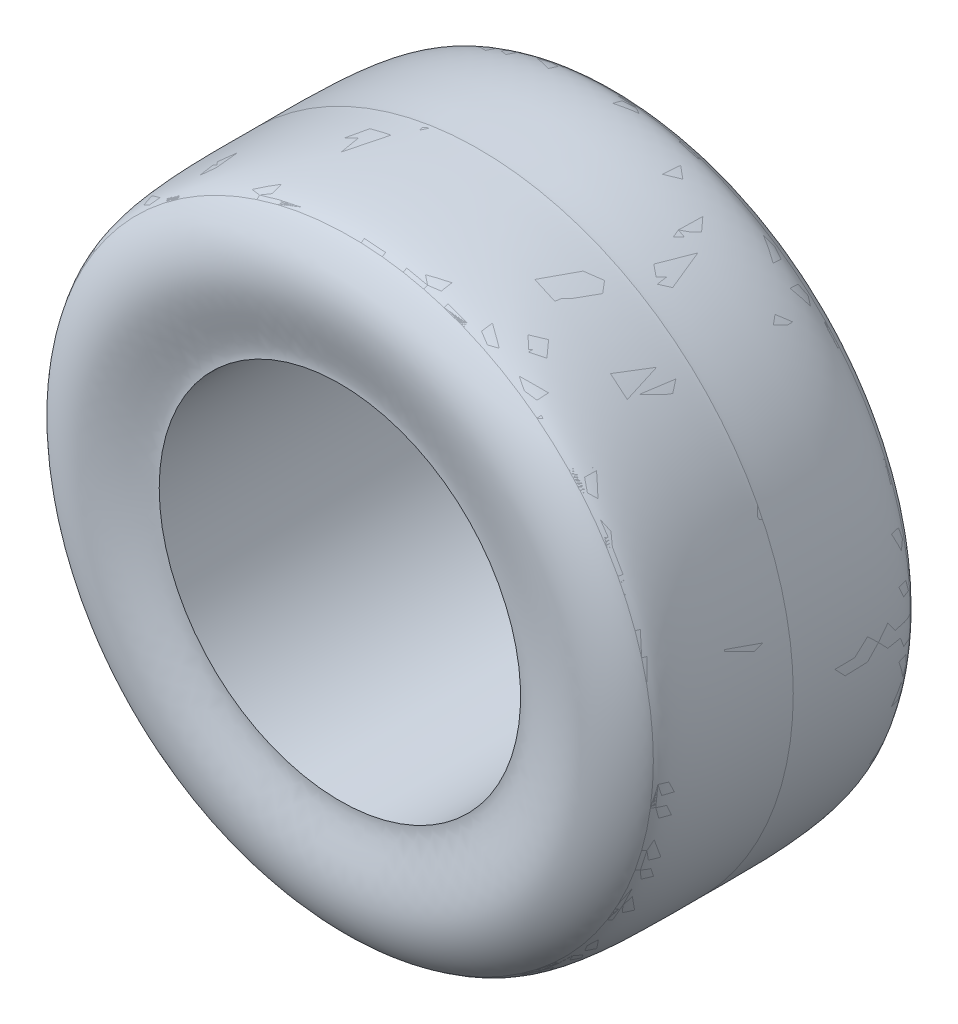
ISO-10303-21;
HEADER;
FILE_DESCRIPTION(('STEP AP214'),'2;1');
FILE_NAME('part.step','',(''),(''),'','','');
FILE_SCHEMA(('AUTOMOTIVE_DESIGN { 1 0 10303 214 1 1 1 1 }'));
ENDSEC;
DATA;
#1=APPLICATION_CONTEXT('core data for automotive mechanical design processes');
#2=APPLICATION_PROTOCOL_DEFINITION('international standard','automotive_design',2000,#1);
#3=PRODUCT_CONTEXT('',#1,'mechanical');
#4=PRODUCT('Part','Part','',(#3));
#5=PRODUCT_RELATED_PRODUCT_CATEGORY('part','',(#4));
#6=PRODUCT_DEFINITION_FORMATION('','',#4);
#7=PRODUCT_DEFINITION_CONTEXT('part definition',#1,'design');
#8=PRODUCT_DEFINITION('design','',#6,#7);
#9=PRODUCT_DEFINITION_SHAPE('','',#8);
#10=(LENGTH_UNIT() NAMED_UNIT(*) SI_UNIT(.MILLI.,.METRE.));
#11=(NAMED_UNIT(*) PLANE_ANGLE_UNIT() SI_UNIT($,.RADIAN.));
#12=(NAMED_UNIT(*) SI_UNIT($,.STERADIAN.) SOLID_ANGLE_UNIT());
#13=UNCERTAINTY_MEASURE_WITH_UNIT(LENGTH_MEASURE(1.E-05),#10,'distance_accuracy_value','');
#14=(GEOMETRIC_REPRESENTATION_CONTEXT(3) GLOBAL_UNCERTAINTY_ASSIGNED_CONTEXT((#13)) GLOBAL_UNIT_ASSIGNED_CONTEXT((#10,
#11,#12)) REPRESENTATION_CONTEXT('',''));
#15=CARTESIAN_POINT('',(0.,0.,0.));
#16=DIRECTION('',(0.,0.,1.));
#17=DIRECTION('',(1.,0.,0.));
#18=AXIS2_PLACEMENT_3D('',#15,#16,#17);
#19=CARTESIAN_POINT('',(6.66133814775094E-13,286.999999999999,0.));
#20=CARTESIAN_POINT('',(0.,286.826687195733,-4.07927990424906));
#21=CARTESIAN_POINT('',(4.44089209850063E-13,288.284046758604,-106.061876701454));
#22=CARTESIAN_POINT('',(4.44089209850063E-13,278.88009318183,-113.606283575162));
#23=CARTESIAN_POINT('',(4.44089209850063E-13,276.507310694476,-117.286167083316));
#24=B_SPLINE_CURVE_WITH_KNOTS('',3,(#19,#20,#21,#22,#23),.UNSPECIFIED.,.F.,.F.,(4,1,4),(0.,
0.0647514781094205,0.299257628346607),.UNSPECIFIED.);
#25=CARTESIAN_POINT('',(4.44089209850063E-13,-8.88178419700125E-13,146.251356053782));
#26=DIRECTION('',(0.,0.,1.));
#27=AXIS1_PLACEMENT('',#25,#26);
#28=SURFACE_OF_REVOLUTION('',#24,#27);
#29=CARTESIAN_POINT('',(2.22044604925031E-13,0.,-117.286167083317));
#30=DIRECTION('',(0.,0.,1.));
#31=DIRECTION('',(1.,0.,0.));
#32=AXIS2_PLACEMENT_3D('',#29,#30,#31);
#33=CIRCLE('',#32,276.507310694478);
#34=CARTESIAN_POINT('',(276.507310694478,0.,-117.286167083317));
#35=VERTEX_POINT('',#34);
#36=EDGE_CURVE('E11',#35,#35,#33,.T.);
#37=ORIENTED_EDGE('',*,*,#36,.T.);
#38=EDGE_LOOP('',(#37));
#39=FACE_BOUND('',#38,.T.);
#40=CARTESIAN_POINT('',(0.,0.,0.));
#41=DIRECTION('',(0.,0.,1.));
#42=DIRECTION('',(1.,0.,0.));
#43=AXIS2_PLACEMENT_3D('',#40,#41,#42);
#44=CIRCLE('',#43,287.);
#45=CARTESIAN_POINT('',(287.,0.,0.));
#46=VERTEX_POINT('',#45);
#47=EDGE_CURVE('E53',#46,#46,#44,.T.);
#48=ORIENTED_EDGE('',*,*,#47,.F.);
#49=EDGE_LOOP('',(#48));
#50=FACE_BOUND('',#49,.T.);
#51=ADVANCED_FACE('F47',(#39,#50),#28,.F.);
#52=CARTESIAN_POINT('',(6.66133814775094E-13,286.999999999999,0.));
#53=CARTESIAN_POINT('',(4.44089209850063E-13,286.826687195733,4.07927990424917));
#54=CARTESIAN_POINT('',(0.,288.284046758605,106.06187670146));
#55=CARTESIAN_POINT('',(4.44089209850063E-13,278.88009318183,113.606283575162));
#56=CARTESIAN_POINT('',(2.22044604925031E-13,276.507310694477,117.286167083317));
#57=B_SPLINE_CURVE_WITH_KNOTS('',3,(#52,#53,#54,#55,#56),.UNSPECIFIED.,.F.,.F.,(4,1,4),(0.,
0.0647514781094217,0.299257628346619),.UNSPECIFIED.);
#58=CARTESIAN_POINT('',(4.44089209850063E-13,-8.88178419700125E-13,146.251356053782));
#59=DIRECTION('',(0.,0.,1.));
#60=AXIS1_PLACEMENT('',#58,#59);
#61=SURFACE_OF_REVOLUTION('',#57,#60);
#62=CARTESIAN_POINT('',(0.,-1.33226762955019E-12,117.286167083317));
#63=DIRECTION('',(0.,0.,1.));
#64=DIRECTION('',(1.,0.,0.));
#65=AXIS2_PLACEMENT_3D('',#62,#63,#64);
#66=CIRCLE('',#65,276.507310694478);
#67=CARTESIAN_POINT('',(276.507310694478,-1.32773740710641E-12,117.286167083317));
#68=VERTEX_POINT('',#67);
#69=EDGE_CURVE('E60',#68,#68,#66,.T.);
#70=ORIENTED_EDGE('',*,*,#69,.F.);
#71=EDGE_LOOP('',(#70));
#72=FACE_BOUND('',#71,.T.);
#73=ORIENTED_EDGE('',*,*,#47,.T.);
#74=EDGE_LOOP('',(#73));
#75=FACE_BOUND('',#74,.T.);
#76=ADVANCED_FACE('F78',(#72,#75),#61,.T.);
#77=OPEN_SHELL('',(#51,#76));
#78=SHELL_BASED_SURFACE_MODEL('B2',(#77));
#79=CARTESIAN_POINT('',(2.22044604925031E-13,276.507310694477,117.286167083317));
#80=CARTESIAN_POINT('',(4.44089209850063E-13,276.352628775456,117.526059043853));
#81=CARTESIAN_POINT('',(0.,273.033066490221,123.196173431544));
#82=CARTESIAN_POINT('',(0.,236.210615054694,155.207133320947));
#83=CARTESIAN_POINT('',(4.44089209850063E-13,177.981971129758,126.019447419683));
#84=CARTESIAN_POINT('',(2.22044604925031E-13,164.999999999999,127.));
#85=B_SPLINE_CURVE_WITH_KNOTS('',3,(#79,#80,#81,#82,#83,#84),.UNSPECIFIED.,.F.,.F.,(4,1,1,4),
(0.299257628346619,0.314545106880506,0.697277584134524,1.),.UNSPECIFIED.);
#86=CARTESIAN_POINT('',(4.44089209850063E-13,-8.88178419700125E-13,-194.897474353297));
#87=DIRECTION('',(0.,0.,-1.));
#88=AXIS1_PLACEMENT('',#86,#87);
#89=SURFACE_OF_REVOLUTION('',#85,#88);
#90=CARTESIAN_POINT('',(2.22044604925031E-13,-8.88178419700125E-13,127.));
#91=DIRECTION('',(0.,0.,-1.));
#92=DIRECTION('',(-1.,0.,0.));
#93=AXIS2_PLACEMENT_3D('',#90,#91,#92);
#94=CIRCLE('',#93,165.);
#95=CARTESIAN_POINT('',(-165.,-8.90881735939199E-13,127.));
#96=VERTEX_POINT('',#95);
#97=EDGE_CURVE('E46',#96,#96,#94,.T.);
#98=ORIENTED_EDGE('',*,*,#97,.T.);
#99=EDGE_LOOP('',(#98));
#100=FACE_BOUND('',#99,.T.);
#101=CARTESIAN_POINT('',(0.,-1.33226762955019E-12,117.286167083317));
#102=DIRECTION('',(0.,0.,-1.));
#103=DIRECTION('',(-1.,0.,0.));
#104=AXIS2_PLACEMENT_3D('',#101,#102,#103);
#105=CIRCLE('',#104,276.507310694478);
#106=CARTESIAN_POINT('',(-276.507310694478,-1.33679785199396E-12,117.286167083317));
#107=VERTEX_POINT('',#106);
#108=EDGE_CURVE('E130',#107,#107,#105,.T.);
#109=ORIENTED_EDGE('',*,*,#108,.F.);
#110=EDGE_LOOP('',(#109));
#111=FACE_BOUND('',#110,.T.);
#112=ADVANCED_FACE('F115',(#100,#111),#89,.F.);
#113=CARTESIAN_POINT('',(4.44089209850063E-13,-8.88178419700125E-13,-194.897474353297));
#114=DIRECTION('',(0.,0.,-1.));
#115=DIRECTION('',(-1.,0.,0.));
#116=AXIS2_PLACEMENT_3D('',#113,#114,#115);
#117=CYLINDRICAL_SURFACE('',#116,165.);
#118=CARTESIAN_POINT('',(0.,0.,-127.));
#119=DIRECTION('',(0.,0.,-1.));
#120=DIRECTION('',(-1.,0.,0.));
#121=AXIS2_PLACEMENT_3D('',#118,#119,#120);
#122=CIRCLE('',#121,165.);
#123=CARTESIAN_POINT('',(-165.,0.,-127.));
#124=VERTEX_POINT('',#123);
#125=EDGE_CURVE('E122',#124,#124,#122,.T.);
#126=ORIENTED_EDGE('',*,*,#125,.T.);
#127=EDGE_LOOP('',(#126));
#128=FACE_BOUND('',#127,.T.);
#129=ORIENTED_EDGE('',*,*,#97,.F.);
#130=EDGE_LOOP('',(#129));
#131=FACE_BOUND('',#130,.T.);
#132=ADVANCED_FACE('F149',(#128,#131),#117,.F.);
#133=CARTESIAN_POINT('',(2.22044604925031E-13,164.999999999999,-127.));
#134=CARTESIAN_POINT('',(0.,177.981971129758,-126.019447419682));
#135=CARTESIAN_POINT('',(4.44089209850063E-13,236.210615054692,-155.207133320948));
#136=CARTESIAN_POINT('',(6.66133814775094E-13,273.033066490226,-123.196173431542));
#137=CARTESIAN_POINT('',(2.22044604925031E-13,276.352628775456,-117.526059043852));
#138=CARTESIAN_POINT('',(4.44089209850063E-13,276.507310694476,-117.286167083316));
#139=B_SPLINE_CURVE_WITH_KNOTS('',3,(#133,#134,#135,#136,#137,#138),.UNSPECIFIED.,.F.,.F.,(4,1,
1,4),(0.299257628346607,0.601980044212084,0.984712521466101,1.),.UNSPECIFIED.);
#140=CARTESIAN_POINT('',(4.44089209850063E-13,-8.88178419700125E-13,-194.897474353297));
#141=DIRECTION('',(0.,0.,-1.));
#142=AXIS1_PLACEMENT('',#140,#141);
#143=SURFACE_OF_REVOLUTION('',#139,#142);
#144=CARTESIAN_POINT('',(2.22044604925031E-13,0.,-117.286167083317));
#145=DIRECTION('',(0.,0.,-1.));
#146=DIRECTION('',(-1.,0.,0.));
#147=AXIS2_PLACEMENT_3D('',#144,#145,#146);
#148=CIRCLE('',#147,276.507310694478);
#149=CARTESIAN_POINT('',(-276.507310694477,0.,-117.286167083317));
#150=VERTEX_POINT('',#149);
#151=EDGE_CURVE('E126',#150,#150,#148,.T.);
#152=ORIENTED_EDGE('',*,*,#151,.T.);
#153=EDGE_LOOP('',(#152));
#154=FACE_BOUND('',#153,.T.);
#155=ORIENTED_EDGE('',*,*,#125,.F.);
#156=EDGE_LOOP('',(#155));
#157=FACE_BOUND('',#156,.T.);
#158=ADVANCED_FACE('F145',(#154,#157),#143,.F.);
#159=CARTESIAN_POINT('',(4.44089209850063E-13,-8.88178419700125E-13,-194.897474353297));
#160=DIRECTION('',(0.,0.,-1.));
#161=DIRECTION('',(-1.,0.,0.));
#162=AXIS2_PLACEMENT_3D('',#159,#160,#161);
#163=CYLINDRICAL_SURFACE('',#162,276.507310694478);
#164=ORIENTED_EDGE('',*,*,#108,.T.);
#165=EDGE_LOOP('',(#164));
#166=FACE_BOUND('',#165,.T.);
#167=ORIENTED_EDGE('',*,*,#151,.F.);
#168=EDGE_LOOP('',(#167));
#169=FACE_BOUND('',#168,.T.);
#170=ADVANCED_FACE('F148',(#166,#169),#163,.T.);
#171=CLOSED_SHELL('',(#112,#132,#158,#170));
#172=MANIFOLD_SOLID_BREP('B6',#171);
#173=CARTESIAN_POINT('',(0.,287.,0.));
#174=CARTESIAN_POINT('',(0.,286.826687195734,4.07927990424921));
#175=CARTESIAN_POINT('',(0.,288.284046758605,106.061876701459));
#176=CARTESIAN_POINT('',(0.,278.880093181831,113.606283575162));
#177=CARTESIAN_POINT('',(0.,276.507310694478,117.286167083317));
#178=B_SPLINE_CURVE_WITH_KNOTS('',3,(#173,#174,#175,#176,#177),.UNSPECIFIED.,.F.,.F.,(4,1,4),
(0.,0.0647514781094217,0.299257628346619),.UNSPECIFIED.);
#179=CARTESIAN_POINT('',(0.,0.,146.251356053781));
#180=DIRECTION('',(0.,0.,1.));
#181=AXIS1_PLACEMENT('',#179,#180);
#182=SURFACE_OF_REVOLUTION('',#178,#181);
#183=CARTESIAN_POINT('',(0.,0.,117.286167083317));
#184=DIRECTION('',(0.,0.,1.));
#185=DIRECTION('',(1.,0.,0.));
#186=AXIS2_PLACEMENT_3D('',#183,#184,#185);
#187=CIRCLE('',#186,276.507310694478);
#188=CARTESIAN_POINT('',(276.507310694478,0.,117.286167083317));
#189=VERTEX_POINT('',#188);
#190=EDGE_CURVE('E114',#189,#189,#187,.T.);
#191=ORIENTED_EDGE('',*,*,#190,.F.);
#192=EDGE_LOOP('',(#191));
#193=FACE_BOUND('',#192,.T.);
#194=CARTESIAN_POINT('',(0.,0.,0.));
#195=DIRECTION('',(0.,0.,1.));
#196=DIRECTION('',(1.,0.,0.));
#197=AXIS2_PLACEMENT_3D('',#194,#195,#196);
#198=CIRCLE('',#197,287.);
#199=CARTESIAN_POINT('',(287.,0.,0.));
#200=VERTEX_POINT('',#199);
#201=EDGE_CURVE('E216',#200,#200,#198,.T.);
#202=ORIENTED_EDGE('',*,*,#201,.T.);
#203=EDGE_LOOP('',(#202));
#204=FACE_BOUND('',#203,.T.);
#205=ADVANCED_FACE('F205',(#193,#204),#182,.T.);
#206=CARTESIAN_POINT('',(0.,0.,146.251356053781));
#207=DIRECTION('',(0.,0.,1.));
#208=DIRECTION('',(1.,0.,0.));
#209=AXIS2_PLACEMENT_3D('',#206,#207,#208);
#210=CYLINDRICAL_SURFACE('',#209,276.507310694478);
#211=CARTESIAN_POINT('',(0.,0.,-117.286167083316));
#212=DIRECTION('',(0.,0.,1.));
#213=DIRECTION('',(1.,0.,0.));
#214=AXIS2_PLACEMENT_3D('',#211,#212,#213);
#215=CIRCLE('',#214,276.507310694478);
#216=CARTESIAN_POINT('',(276.507310694478,0.,-117.286167083316));
#217=VERTEX_POINT('',#216);
#218=EDGE_CURVE('E212',#217,#217,#215,.T.);
#219=ORIENTED_EDGE('',*,*,#218,.F.);
#220=EDGE_LOOP('',(#219));
#221=FACE_BOUND('',#220,.T.);
#222=ORIENTED_EDGE('',*,*,#190,.T.);
#223=EDGE_LOOP('',(#222));
#224=FACE_BOUND('',#223,.T.);
#225=ADVANCED_FACE('F234',(#221,#224),#210,.F.);
#226=CARTESIAN_POINT('',(0.,287.,0.));
#227=CARTESIAN_POINT('',(0.,286.826687195734,-4.07927990424911));
#228=CARTESIAN_POINT('',(0.,288.284046758605,-106.061876701454));
#229=CARTESIAN_POINT('',(0.,278.880093181831,-113.606283575162));
#230=CARTESIAN_POINT('',(0.,276.507310694478,-117.286167083316));
#231=B_SPLINE_CURVE_WITH_KNOTS('',3,(#226,#227,#228,#229,#230),.UNSPECIFIED.,.F.,.F.,(4,1,4),
(0.,0.0647514781094205,0.299257628346607),.UNSPECIFIED.);
#232=CARTESIAN_POINT('',(0.,0.,146.251356053781));
#233=DIRECTION('',(0.,0.,1.));
#234=AXIS1_PLACEMENT('',#232,#233);
#235=SURFACE_OF_REVOLUTION('',#231,#234);
#236=ORIENTED_EDGE('',*,*,#218,.T.);
#237=EDGE_LOOP('',(#236));
#238=FACE_BOUND('',#237,.T.);
#239=ORIENTED_EDGE('',*,*,#201,.F.);
#240=EDGE_LOOP('',(#239));
#241=FACE_BOUND('',#240,.T.);
#242=ADVANCED_FACE('F232',(#238,#241),#235,.F.);
#243=CLOSED_SHELL('',(#205,#225,#242));
#244=MANIFOLD_SOLID_BREP('B41_NOT_SHOWN',#243);
#245=ADVANCED_BREP_SHAPE_REPRESENTATION('',(#18,#172,#244),#14);
#246=MANIFOLD_SURFACE_SHAPE_REPRESENTATION('',(#18,#78),#14);
#247=SHAPE_REPRESENTATION('',(#18),#14);
#248=SHAPE_DEFINITION_REPRESENTATION(#9,#247);
#249=SHAPE_REPRESENTATION_RELATIONSHIP('','',#247,#245);
#250=SHAPE_REPRESENTATION_RELATIONSHIP('','',#247,#246);
ENDSEC;
END-ISO-10303-21;
